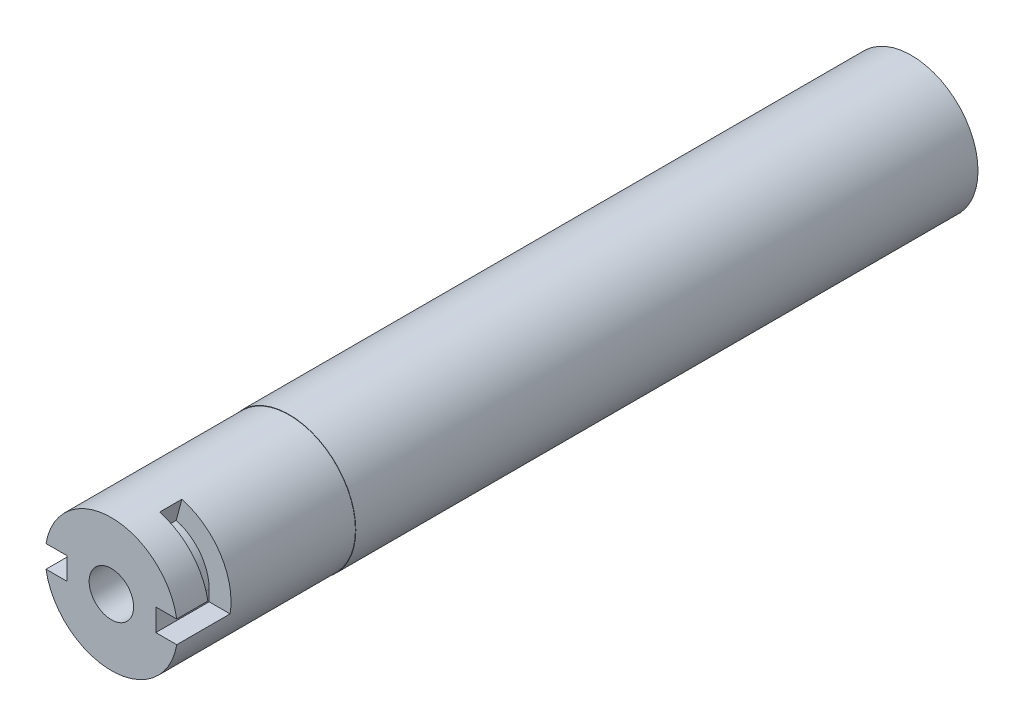
ISO-10303-21;
HEADER;
FILE_DESCRIPTION(('STEP AP214'),'2;1');
FILE_NAME('part.step','',(''),(''),'','','');
FILE_SCHEMA(('AUTOMOTIVE_DESIGN { 1 0 10303 214 1 1 1 1 }'));
ENDSEC;
DATA;
#1=APPLICATION_CONTEXT('core data for automotive mechanical design processes');
#2=APPLICATION_PROTOCOL_DEFINITION('international standard','automotive_design',2000,#1);
#3=PRODUCT_CONTEXT('',#1,'mechanical');
#4=PRODUCT('Part','Part','',(#3));
#5=PRODUCT_RELATED_PRODUCT_CATEGORY('part','',(#4));
#6=PRODUCT_DEFINITION_FORMATION('','',#4);
#7=PRODUCT_DEFINITION_CONTEXT('part definition',#1,'design');
#8=PRODUCT_DEFINITION('design','',#6,#7);
#9=PRODUCT_DEFINITION_SHAPE('','',#8);
#10=(LENGTH_UNIT() NAMED_UNIT(*) SI_UNIT(.MILLI.,.METRE.));
#11=(NAMED_UNIT(*) PLANE_ANGLE_UNIT() SI_UNIT($,.RADIAN.));
#12=(NAMED_UNIT(*) SI_UNIT($,.STERADIAN.) SOLID_ANGLE_UNIT());
#13=UNCERTAINTY_MEASURE_WITH_UNIT(LENGTH_MEASURE(1.E-05),#10,'distance_accuracy_value','');
#14=(GEOMETRIC_REPRESENTATION_CONTEXT(3) GLOBAL_UNCERTAINTY_ASSIGNED_CONTEXT((#13)) GLOBAL_UNIT_ASSIGNED_CONTEXT((#10,
#11,#12)) REPRESENTATION_CONTEXT('',''));
#15=CARTESIAN_POINT('',(0.,0.,0.));
#16=DIRECTION('',(0.,0.,1.));
#17=DIRECTION('',(1.,0.,0.));
#18=AXIS2_PLACEMENT_3D('',#15,#16,#17);
#19=CARTESIAN_POINT('',(0.,0.,114.3));
#20=DIRECTION('',(0.,0.,-1.));
#21=DIRECTION('',(-1.,0.,0.));
#22=AXIS2_PLACEMENT_3D('',#19,#20,#21);
#23=CYLINDRICAL_SURFACE('',#22,9.525);
#24=CARTESIAN_POINT('',(0.,0.,0.));
#25=DIRECTION('',(0.,0.,1.));
#26=DIRECTION('',(1.,0.,0.));
#27=AXIS2_PLACEMENT_3D('',#24,#25,#26);
#28=CIRCLE('',#27,9.525);
#29=CARTESIAN_POINT('',(9.525,0.,0.));
#30=VERTEX_POINT('',#29);
#31=EDGE_CURVE('E240',#30,#30,#28,.T.);
#32=ORIENTED_EDGE('',*,*,#31,.T.);
#33=EDGE_LOOP('',(#32));
#34=FACE_BOUND('',#33,.T.);
#35=CARTESIAN_POINT('',(0.,0.,88.9));
#36=DIRECTION('',(0.,0.,1.));
#37=DIRECTION('',(1.,0.,0.));
#38=AXIS2_PLACEMENT_3D('',#35,#36,#37);
#39=CIRCLE('',#38,9.525);
#40=CARTESIAN_POINT('',(9.525,0.,88.9));
#41=VERTEX_POINT('',#40);
#42=EDGE_CURVE('E362',#41,#41,#39,.T.);
#43=ORIENTED_EDGE('',*,*,#42,.F.);
#44=EDGE_LOOP('',(#43));
#45=FACE_BOUND('',#44,.T.);
#46=ADVANCED_FACE('F41',(#34,#45),#23,.T.);
#47=CARTESIAN_POINT('',(0.,1.5875,106.68));
#48=DIRECTION('',(0.,1.,0.));
#49=DIRECTION('',(0.,0.,1.));
#50=AXIS2_PLACEMENT_3D('',#47,#48,#49);
#51=PLANE('',#50);
#52=DIRECTION('',(0.,0.,1.));
#53=VECTOR('',#52,1.);
#54=CARTESIAN_POINT('',(9.34025210526996,1.5875,88.9));
#55=LINE('',#54,#53);
#56=CARTESIAN_POINT('',(9.34025210526996,1.5875,114.3));
#57=VERTEX_POINT('',#56);
#58=CARTESIAN_POINT('',(9.34025210526996,1.5875,109.855));
#59=VERTEX_POINT('',#58);
#60=EDGE_CURVE('E163',#57,#59,#55,.F.);
#61=ORIENTED_EDGE('',*,*,#60,.F.);
#62=DIRECTION('',(-1.,0.,0.));
#63=VECTOR('',#62,1.);
#64=CARTESIAN_POINT('',(0.,1.5875,114.3));
#65=LINE('',#64,#63);
#66=CARTESIAN_POINT('',(6.35,1.5875,114.3));
#67=VERTEX_POINT('',#66);
#68=EDGE_CURVE('E178',#57,#67,#65,.T.);
#69=ORIENTED_EDGE('',*,*,#68,.T.);
#70=DIRECTION('',(0.,0.,1.));
#71=VECTOR('',#70,1.);
#72=CARTESIAN_POINT('',(6.35,1.5875,106.68));
#73=LINE('',#72,#71);
#74=CARTESIAN_POINT('',(6.35,1.5875,109.855));
#75=VERTEX_POINT('',#74);
#76=EDGE_CURVE('E196',#75,#67,#73,.T.);
#77=ORIENTED_EDGE('',*,*,#76,.F.);
#78=DIRECTION('',(-1.,0.,0.));
#79=VECTOR('',#78,1.);
#80=CARTESIAN_POINT('',(0.,1.5875,109.855));
#81=LINE('',#80,#79);
#82=EDGE_CURVE('E179',#59,#75,#81,.T.);
#83=ORIENTED_EDGE('',*,*,#82,.F.);
#84=EDGE_LOOP('',(#61,#69,#77,#83));
#85=FACE_BOUND('',#84,.T.);
#86=ADVANCED_FACE('F176',(#85),#51,.F.);
#87=CARTESIAN_POINT('',(0.,0.,114.3));
#88=DIRECTION('',(0.,0.,1.));
#89=DIRECTION('',(1.,0.,0.));
#90=AXIS2_PLACEMENT_3D('',#87,#88,#89);
#91=PLANE('',#90);
#92=CARTESIAN_POINT('',(0.,0.,114.3));
#93=DIRECTION('',(0.,0.,1.));
#94=DIRECTION('',(1.,0.,0.));
#95=AXIS2_PLACEMENT_3D('',#92,#93,#94);
#96=CIRCLE('',#95,3.175);
#97=CARTESIAN_POINT('',(3.175,0.,114.3));
#98=VERTEX_POINT('',#97);
#99=EDGE_CURVE('E198',#98,#98,#96,.T.);
#100=ORIENTED_EDGE('',*,*,#99,.F.);
#101=EDGE_LOOP('',(#100));
#102=FACE_BOUND('',#101,.T.);
#103=ORIENTED_EDGE('',*,*,#68,.F.);
#104=CARTESIAN_POINT('',(0.,0.,114.3));
#105=DIRECTION('',(0.,0.,1.));
#106=DIRECTION('',(1.,0.,0.));
#107=AXIS2_PLACEMENT_3D('',#104,#105,#106);
#108=CIRCLE('',#107,9.4742);
#109=CARTESIAN_POINT('',(-9.34025210526996,1.5875,114.3));
#110=VERTEX_POINT('',#109);
#111=EDGE_CURVE('E160',#57,#110,#108,.T.);
#112=ORIENTED_EDGE('',*,*,#111,.T.);
#113=DIRECTION('',(1.,0.,0.));
#114=VECTOR('',#113,1.);
#115=CARTESIAN_POINT('',(0.,1.5875,114.3));
#116=LINE('',#115,#114);
#117=CARTESIAN_POINT('',(-6.35,1.5875,114.3));
#118=VERTEX_POINT('',#117);
#119=EDGE_CURVE('E215',#110,#118,#116,.T.);
#120=ORIENTED_EDGE('',*,*,#119,.T.);
#121=DIRECTION('',(0.,-1.,0.));
#122=VECTOR('',#121,1.);
#123=CARTESIAN_POINT('',(-6.35,0.,114.3));
#124=LINE('',#123,#122);
#125=CARTESIAN_POINT('',(-6.35,-1.5875,114.3));
#126=VERTEX_POINT('',#125);
#127=EDGE_CURVE('E211',#118,#126,#124,.T.);
#128=ORIENTED_EDGE('',*,*,#127,.T.);
#129=DIRECTION('',(-1.,0.,0.));
#130=VECTOR('',#129,1.);
#131=CARTESIAN_POINT('',(0.,-1.5875,114.3));
#132=LINE('',#131,#130);
#133=CARTESIAN_POINT('',(-9.34025210526996,-1.5875,114.3));
#134=VERTEX_POINT('',#133);
#135=EDGE_CURVE('E207',#126,#134,#132,.T.);
#136=ORIENTED_EDGE('',*,*,#135,.T.);
#137=CARTESIAN_POINT('',(9.34025210526996,-1.5875,114.3));
#138=VERTEX_POINT('',#137);
#139=EDGE_CURVE('E172',#134,#138,#108,.T.);
#140=ORIENTED_EDGE('',*,*,#139,.T.);
#141=DIRECTION('',(1.,0.,0.));
#142=VECTOR('',#141,1.);
#143=CARTESIAN_POINT('',(0.,-1.5875,114.3));
#144=LINE('',#143,#142);
#145=CARTESIAN_POINT('',(6.35,-1.5875,114.3));
#146=VERTEX_POINT('',#145);
#147=EDGE_CURVE('E186',#146,#138,#144,.T.);
#148=ORIENTED_EDGE('',*,*,#147,.F.);
#149=DIRECTION('',(0.,-1.,0.));
#150=VECTOR('',#149,1.);
#151=CARTESIAN_POINT('',(6.35,0.,114.3));
#152=LINE('',#151,#150);
#153=EDGE_CURVE('E68',#67,#146,#152,.T.);
#154=ORIENTED_EDGE('',*,*,#153,.F.);
#155=EDGE_LOOP('',(#103,#112,#120,#128,#136,#140,#148,#154));
#156=FACE_BOUND('',#155,.T.);
#157=ADVANCED_FACE('F183',(#102,#156),#91,.T.);
#158=CARTESIAN_POINT('',(0.,-1.5875,106.68));
#159=DIRECTION('',(0.,1.,0.));
#160=DIRECTION('',(0.,0.,1.));
#161=AXIS2_PLACEMENT_3D('',#158,#159,#160);
#162=PLANE('',#161);
#163=DIRECTION('',(1.,0.,0.));
#164=VECTOR('',#163,1.);
#165=CARTESIAN_POINT('',(0.,-1.5875,109.855));
#166=LINE('',#165,#164);
#167=CARTESIAN_POINT('',(-9.34025210526996,-1.5875,109.855));
#168=VERTEX_POINT('',#167);
#169=CARTESIAN_POINT('',(-6.35,-1.5875,109.855));
#170=VERTEX_POINT('',#169);
#171=EDGE_CURVE('E49',#168,#170,#166,.T.);
#172=ORIENTED_EDGE('',*,*,#171,.F.);
#173=DIRECTION('',(0.,0.,1.));
#174=VECTOR('',#173,1.);
#175=CARTESIAN_POINT('',(-9.34025210526996,-1.5875,88.9));
#176=LINE('',#175,#174);
#177=EDGE_CURVE('E269',#168,#134,#176,.T.);
#178=ORIENTED_EDGE('',*,*,#177,.T.);
#179=ORIENTED_EDGE('',*,*,#135,.F.);
#180=DIRECTION('',(0.,0.,1.));
#181=VECTOR('',#180,1.);
#182=CARTESIAN_POINT('',(-6.35,-1.5875,106.68));
#183=LINE('',#182,#181);
#184=EDGE_CURVE('E222',#170,#126,#183,.T.);
#185=ORIENTED_EDGE('',*,*,#184,.F.);
#186=EDGE_LOOP('',(#172,#178,#179,#185));
#187=FACE_BOUND('',#186,.T.);
#188=ADVANCED_FACE('F268',(#187),#162,.T.);
#189=CARTESIAN_POINT('',(0.,1.5875,106.68));
#190=DIRECTION('',(0.,-1.,0.));
#191=DIRECTION('',(0.,0.,-1.));
#192=AXIS2_PLACEMENT_3D('',#189,#190,#191);
#193=PLANE('',#192);
#194=ORIENTED_EDGE('',*,*,#119,.F.);
#195=DIRECTION('',(0.,0.,1.));
#196=VECTOR('',#195,1.);
#197=CARTESIAN_POINT('',(-9.34025210526996,1.5875,88.9));
#198=LINE('',#197,#196);
#199=CARTESIAN_POINT('',(-9.34025210526996,1.5875,106.68));
#200=VERTEX_POINT('',#199);
#201=EDGE_CURVE('E166',#110,#200,#198,.F.);
#202=ORIENTED_EDGE('',*,*,#201,.T.);
#203=DIRECTION('',(1.,0.,0.));
#204=VECTOR('',#203,1.);
#205=CARTESIAN_POINT('',(0.,1.5875,106.68));
#206=LINE('',#205,#204);
#207=CARTESIAN_POINT('',(-6.35,1.5875,106.68));
#208=VERTEX_POINT('',#207);
#209=EDGE_CURVE('E206',#200,#208,#206,.T.);
#210=ORIENTED_EDGE('',*,*,#209,.T.);
#211=DIRECTION('',(0.,0.,1.));
#212=VECTOR('',#211,1.);
#213=CARTESIAN_POINT('',(-6.35,1.5875,106.68));
#214=LINE('',#213,#212);
#215=EDGE_CURVE('E210',#208,#118,#214,.T.);
#216=ORIENTED_EDGE('',*,*,#215,.T.);
#217=EDGE_LOOP('',(#194,#202,#210,#216));
#218=FACE_BOUND('',#217,.T.);
#219=ADVANCED_FACE('F274',(#218),#193,.T.);
#220=CARTESIAN_POINT('',(0.,0.,106.68));
#221=DIRECTION('',(0.,0.,1.));
#222=DIRECTION('',(1.,0.,0.));
#223=AXIS2_PLACEMENT_3D('',#220,#221,#222);
#224=PLANE('',#223);
#225=ORIENTED_EDGE('',*,*,#209,.F.);
#226=CARTESIAN_POINT('',(0.,0.,106.68));
#227=DIRECTION('',(0.,0.,1.));
#228=DIRECTION('',(1.,0.,0.));
#229=AXIS2_PLACEMENT_3D('',#226,#227,#228);
#230=CIRCLE('',#229,9.4742);
#231=CARTESIAN_POINT('',(-2.45210339711027,-9.1513744634279,106.68));
#232=VERTEX_POINT('',#231);
#233=EDGE_CURVE('E280',#200,#232,#230,.T.);
#234=ORIENTED_EDGE('',*,*,#233,.T.);
#235=DIRECTION('',(-0.258819045102518,-0.965925826289069,0.));
#236=VECTOR('',#235,1.);
#237=CARTESIAN_POINT('',(-2.43077066583678,-9.07175962645105,106.68));
#238=LINE('',#237,#236);
#239=CARTESIAN_POINT('',(-1.64350093640097,-6.13362899693558,106.68));
#240=VERTEX_POINT('',#239);
#241=EDGE_CURVE('E283',#240,#232,#238,.T.);
#242=ORIENTED_EDGE('',*,*,#241,.F.);
#243=CARTESIAN_POINT('',(0.,0.,106.68));
#244=DIRECTION('',(0.,0.,-1.));
#245=DIRECTION('',(-1.,0.,0.));
#246=AXIS2_PLACEMENT_3D('',#243,#244,#245);
#247=CIRCLE('',#246,6.34999999999999);
#248=CARTESIAN_POINT('',(-6.34999999999998,0.,106.68));
#249=VERTEX_POINT('',#248);
#250=EDGE_CURVE('E282',#240,#249,#247,.T.);
#251=ORIENTED_EDGE('',*,*,#250,.T.);
#252=DIRECTION('',(0.,-1.,0.));
#253=VECTOR('',#252,1.);
#254=CARTESIAN_POINT('',(-6.35,0.,106.68));
#255=LINE('',#254,#253);
#256=EDGE_CURVE('E202',#208,#249,#255,.T.);
#257=ORIENTED_EDGE('',*,*,#256,.F.);
#258=EDGE_LOOP('',(#225,#234,#242,#251,#257));
#259=FACE_BOUND('',#258,.T.);
#260=ADVANCED_FACE('F278',(#259),#224,.T.);
#261=CARTESIAN_POINT('',(0.,-1.5875,106.68));
#262=DIRECTION('',(0.,-1.,0.));
#263=DIRECTION('',(0.,0.,-1.));
#264=AXIS2_PLACEMENT_3D('',#261,#262,#263);
#265=PLANE('',#264);
#266=DIRECTION('',(0.,0.,1.));
#267=VECTOR('',#266,1.);
#268=CARTESIAN_POINT('',(9.34025210526996,-1.5875,88.9));
#269=LINE('',#268,#267);
#270=CARTESIAN_POINT('',(9.34025210526996,-1.5875,106.68));
#271=VERTEX_POINT('',#270);
#272=EDGE_CURVE('E181',#271,#138,#269,.T.);
#273=ORIENTED_EDGE('',*,*,#272,.F.);
#274=DIRECTION('',(1.,0.,0.));
#275=VECTOR('',#274,1.);
#276=CARTESIAN_POINT('',(0.,-1.5875,106.68));
#277=LINE('',#276,#275);
#278=CARTESIAN_POINT('',(6.35,-1.5875,106.68));
#279=VERTEX_POINT('',#278);
#280=EDGE_CURVE('E189',#279,#271,#277,.T.);
#281=ORIENTED_EDGE('',*,*,#280,.F.);
#282=DIRECTION('',(0.,0.,1.));
#283=VECTOR('',#282,1.);
#284=CARTESIAN_POINT('',(6.35,-1.5875,106.68));
#285=LINE('',#284,#283);
#286=EDGE_CURVE('E199',#279,#146,#285,.T.);
#287=ORIENTED_EDGE('',*,*,#286,.T.);
#288=ORIENTED_EDGE('',*,*,#147,.T.);
#289=EDGE_LOOP('',(#273,#281,#287,#288));
#290=FACE_BOUND('',#289,.T.);
#291=ADVANCED_FACE('F389',(#290),#265,.F.);
#292=CARTESIAN_POINT('',(0.,0.,106.68));
#293=DIRECTION('',(0.,0.,1.));
#294=DIRECTION('',(1.,0.,0.));
#295=AXIS2_PLACEMENT_3D('',#292,#293,#294);
#296=PLANE('',#295);
#297=ORIENTED_EDGE('',*,*,#280,.T.);
#298=CARTESIAN_POINT('',(0.,0.,106.68));
#299=DIRECTION('',(0.,0.,1.));
#300=DIRECTION('',(1.,0.,0.));
#301=AXIS2_PLACEMENT_3D('',#298,#299,#300);
#302=CIRCLE('',#301,9.4742);
#303=CARTESIAN_POINT('',(2.45210339711029,9.1513744634279,106.68));
#304=VERTEX_POINT('',#303);
#305=EDGE_CURVE('E382',#271,#304,#302,.T.);
#306=ORIENTED_EDGE('',*,*,#305,.T.);
#307=DIRECTION('',(-0.258819045102518,-0.965925826289069,0.));
#308=VECTOR('',#307,1.);
#309=CARTESIAN_POINT('',(2.46525140460149,9.20044349540337,106.68));
#310=LINE('',#309,#308);
#311=CARTESIAN_POINT('',(1.643500936401,6.13362899693558,106.68));
#312=VERTEX_POINT('',#311);
#313=EDGE_CURVE('E316',#304,#312,#310,.T.);
#314=ORIENTED_EDGE('',*,*,#313,.T.);
#315=CARTESIAN_POINT('',(0.,0.,106.68));
#316=DIRECTION('',(0.,0.,-1.));
#317=DIRECTION('',(-1.,0.,0.));
#318=AXIS2_PLACEMENT_3D('',#315,#316,#317);
#319=CIRCLE('',#318,6.34999999999999);
#320=CARTESIAN_POINT('',(6.35,0.,106.68));
#321=VERTEX_POINT('',#320);
#322=EDGE_CURVE('E298',#312,#321,#319,.T.);
#323=ORIENTED_EDGE('',*,*,#322,.T.);
#324=DIRECTION('',(0.,-1.,0.));
#325=VECTOR('',#324,1.);
#326=CARTESIAN_POINT('',(6.35,0.,106.68));
#327=LINE('',#326,#325);
#328=EDGE_CURVE('E185',#321,#279,#327,.T.);
#329=ORIENTED_EDGE('',*,*,#328,.T.);
#330=EDGE_LOOP('',(#297,#306,#314,#323,#329));
#331=FACE_BOUND('',#330,.T.);
#332=ADVANCED_FACE('F391',(#331),#296,.T.);
#333=CARTESIAN_POINT('',(1.643500936401,6.13362899693558,109.855));
#334=DIRECTION('',(0.,0.,-1.));
#335=DIRECTION('',(-1.,0.,0.));
#336=AXIS2_PLACEMENT_3D('',#333,#334,#335);
#337=PLANE('',#336);
#338=DIRECTION('',(0.258819045102518,0.965925826289069,0.));
#339=VECTOR('',#338,1.);
#340=CARTESIAN_POINT('',(1.643500936401,6.13362899693558,109.855));
#341=LINE('',#340,#339);
#342=CARTESIAN_POINT('',(1.643500936401,6.13362899693558,109.855));
#343=VERTEX_POINT('',#342);
#344=CARTESIAN_POINT('',(2.45210339711029,9.1513744634279,109.855));
#345=VERTEX_POINT('',#344);
#346=EDGE_CURVE('E327',#343,#345,#341,.T.);
#347=ORIENTED_EDGE('',*,*,#346,.T.);
#348=CARTESIAN_POINT('',(0.,0.,109.855));
#349=DIRECTION('',(0.,0.,-1.));
#350=DIRECTION('',(-1.,0.,0.));
#351=AXIS2_PLACEMENT_3D('',#348,#349,#350);
#352=CIRCLE('',#351,9.4742);
#353=EDGE_CURVE('E380',#345,#59,#352,.T.);
#354=ORIENTED_EDGE('',*,*,#353,.T.);
#355=ORIENTED_EDGE('',*,*,#82,.T.);
#356=DIRECTION('',(0.,-1.,0.));
#357=VECTOR('',#356,1.);
#358=CARTESIAN_POINT('',(6.35,0.,109.855));
#359=LINE('',#358,#357);
#360=CARTESIAN_POINT('',(6.35,0.,109.855));
#361=VERTEX_POINT('',#360);
#362=EDGE_CURVE('E266',#75,#361,#359,.T.);
#363=ORIENTED_EDGE('',*,*,#362,.T.);
#364=CARTESIAN_POINT('',(0.,0.,109.855));
#365=DIRECTION('',(0.,0.,-1.));
#366=DIRECTION('',(-1.,0.,0.));
#367=AXIS2_PLACEMENT_3D('',#364,#365,#366);
#368=CIRCLE('',#367,6.34999999999999);
#369=EDGE_CURVE('E314',#343,#361,#368,.T.);
#370=ORIENTED_EDGE('',*,*,#369,.F.);
#371=EDGE_LOOP('',(#347,#354,#355,#363,#370));
#372=FACE_BOUND('',#371,.T.);
#373=ADVANCED_FACE('F336',(#372),#337,.T.);
#374=CARTESIAN_POINT('',(0.,0.,0.));
#375=DIRECTION('',(-0.965925826289069,0.258819045102518,0.));
#376=DIRECTION('',(0.,0.,1.));
#377=AXIS2_PLACEMENT_3D('',#374,#375,#376);
#378=PLANE('',#377);
#379=DIRECTION('',(0.,0.,1.));
#380=VECTOR('',#379,1.);
#381=CARTESIAN_POINT('',(2.45210339711029,9.1513744634279,88.9));
#382=LINE('',#381,#380);
#383=EDGE_CURVE('E378',#345,#304,#382,.F.);
#384=ORIENTED_EDGE('',*,*,#383,.F.);
#385=ORIENTED_EDGE('',*,*,#346,.F.);
#386=DIRECTION('',(0.,0.,1.));
#387=VECTOR('',#386,1.);
#388=CARTESIAN_POINT('',(1.643500936401,6.13362899693558,106.68));
#389=LINE('',#388,#387);
#390=EDGE_CURVE('E321',#312,#343,#389,.T.);
#391=ORIENTED_EDGE('',*,*,#390,.F.);
#392=ORIENTED_EDGE('',*,*,#313,.F.);
#393=EDGE_LOOP('',(#384,#385,#391,#392));
#394=FACE_BOUND('',#393,.T.);
#395=ADVANCED_FACE('F395',(#394),#378,.F.);
#396=CARTESIAN_POINT('',(-1.64350093640097,-6.13362899693558,109.855));
#397=DIRECTION('',(0.,0.,1.));
#398=DIRECTION('',(1.,0.,0.));
#399=AXIS2_PLACEMENT_3D('',#396,#397,#398);
#400=PLANE('',#399);
#401=CARTESIAN_POINT('',(0.,0.,109.855));
#402=DIRECTION('',(0.,0.,1.));
#403=DIRECTION('',(1.,0.,0.));
#404=AXIS2_PLACEMENT_3D('',#401,#402,#403);
#405=CIRCLE('',#404,9.4742);
#406=CARTESIAN_POINT('',(-2.45210339711026,-9.1513744634279,109.855));
#407=VERTEX_POINT('',#406);
#408=EDGE_CURVE('E58',#168,#407,#405,.T.);
#409=ORIENTED_EDGE('',*,*,#408,.F.);
#410=ORIENTED_EDGE('',*,*,#171,.T.);
#411=DIRECTION('',(0.,1.,0.));
#412=VECTOR('',#411,1.);
#413=CARTESIAN_POINT('',(-6.35,0.,109.855));
#414=LINE('',#413,#412);
#415=CARTESIAN_POINT('',(-6.34999999999998,0.,109.855));
#416=VERTEX_POINT('',#415);
#417=EDGE_CURVE('E216',#170,#416,#414,.T.);
#418=ORIENTED_EDGE('',*,*,#417,.T.);
#419=CARTESIAN_POINT('',(0.,0.,109.855));
#420=DIRECTION('',(0.,0.,-1.));
#421=DIRECTION('',(-1.,0.,0.));
#422=AXIS2_PLACEMENT_3D('',#419,#420,#421);
#423=CIRCLE('',#422,6.34999999999999);
#424=CARTESIAN_POINT('',(-1.64350093640097,-6.13362899693558,109.855));
#425=VERTEX_POINT('',#424);
#426=EDGE_CURVE('E288',#425,#416,#423,.T.);
#427=ORIENTED_EDGE('',*,*,#426,.F.);
#428=DIRECTION('',(0.258819045102518,0.965925826289069,0.));
#429=VECTOR('',#428,1.);
#430=CARTESIAN_POINT('',(-1.64350093640097,-6.13362899693558,109.855));
#431=LINE('',#430,#429);
#432=EDGE_CURVE('E289',#407,#425,#431,.T.);
#433=ORIENTED_EDGE('',*,*,#432,.F.);
#434=EDGE_LOOP('',(#409,#410,#418,#427,#433));
#435=FACE_BOUND('',#434,.T.);
#436=ADVANCED_FACE('F252',(#435),#400,.F.);
#437=CARTESIAN_POINT('',(0.,0.,0.));
#438=DIRECTION('',(0.965925826289069,-0.258819045102518,0.));
#439=DIRECTION('',(0.,0.,-1.));
#440=AXIS2_PLACEMENT_3D('',#437,#438,#439);
#441=PLANE('',#440);
#442=DIRECTION('',(0.,0.,1.));
#443=VECTOR('',#442,1.);
#444=CARTESIAN_POINT('',(-2.45210339711027,-9.1513744634279,88.9));
#445=LINE('',#444,#443);
#446=EDGE_CURVE('E12',#407,#232,#445,.F.);
#447=ORIENTED_EDGE('',*,*,#446,.F.);
#448=ORIENTED_EDGE('',*,*,#432,.T.);
#449=DIRECTION('',(0.,0.,-1.));
#450=VECTOR('',#449,1.);
#451=CARTESIAN_POINT('',(-1.64350093640097,-6.13362899693558,106.68));
#452=LINE('',#451,#450);
#453=EDGE_CURVE('E293',#425,#240,#452,.T.);
#454=ORIENTED_EDGE('',*,*,#453,.T.);
#455=ORIENTED_EDGE('',*,*,#241,.T.);
#456=EDGE_LOOP('',(#447,#448,#454,#455));
#457=FACE_BOUND('',#456,.T.);
#458=ADVANCED_FACE('F340',(#457),#441,.F.);
#459=CARTESIAN_POINT('',(6.35,0.,106.68));
#460=DIRECTION('',(-1.,0.,0.));
#461=DIRECTION('',(0.,0.,1.));
#462=AXIS2_PLACEMENT_3D('',#459,#460,#461);
#463=PLANE('',#462);
#464=ORIENTED_EDGE('',*,*,#362,.F.);
#465=ORIENTED_EDGE('',*,*,#76,.T.);
#466=ORIENTED_EDGE('',*,*,#153,.T.);
#467=ORIENTED_EDGE('',*,*,#286,.F.);
#468=ORIENTED_EDGE('',*,*,#328,.F.);
#469=DIRECTION('',(0.,0.,1.));
#470=VECTOR('',#469,1.);
#471=CARTESIAN_POINT('',(6.35,0.,106.68));
#472=LINE('',#471,#470);
#473=EDGE_CURVE('E306',#321,#361,#472,.T.);
#474=ORIENTED_EDGE('',*,*,#473,.T.);
#475=EDGE_LOOP('',(#464,#465,#466,#467,#468,#474));
#476=FACE_BOUND('',#475,.T.);
#477=ADVANCED_FACE('F337',(#476),#463,.F.);
#478=CARTESIAN_POINT('',(0.,0.,0.));
#479=DIRECTION('',(0.,0.,1.));
#480=DIRECTION('',(1.,0.,0.));
#481=AXIS2_PLACEMENT_3D('',#478,#479,#480);
#482=PLANE('',#481);
#483=CARTESIAN_POINT('',(0.,0.,0.));
#484=DIRECTION('',(0.,0.,-1.));
#485=DIRECTION('',(-1.,0.,0.));
#486=AXIS2_PLACEMENT_3D('',#483,#484,#485);
#487=CIRCLE('',#486,5.55625);
#488=CARTESIAN_POINT('',(-5.55625,0.,0.));
#489=VERTEX_POINT('',#488);
#490=EDGE_CURVE('E232',#489,#489,#487,.T.);
#491=ORIENTED_EDGE('',*,*,#490,.F.);
#492=EDGE_LOOP('',(#491));
#493=FACE_BOUND('',#492,.T.);
#494=ORIENTED_EDGE('',*,*,#31,.F.);
#495=EDGE_LOOP('',(#494));
#496=FACE_BOUND('',#495,.T.);
#497=ADVANCED_FACE('F339',(#493,#496),#482,.F.);
#498=CARTESIAN_POINT('',(0.,0.,101.6));
#499=DIRECTION('',(0.,0.,1.));
#500=DIRECTION('',(1.,0.,0.));
#501=AXIS2_PLACEMENT_3D('',#498,#499,#500);
#502=PLANE('',#501);
#503=CARTESIAN_POINT('',(0.,0.,101.6));
#504=DIRECTION('',(0.,0.,1.));
#505=DIRECTION('',(1.,0.,0.));
#506=AXIS2_PLACEMENT_3D('',#503,#504,#505);
#507=CIRCLE('',#506,3.175);
#508=CARTESIAN_POINT('',(3.175,0.,101.6));
#509=VERTEX_POINT('',#508);
#510=EDGE_CURVE('E231',#509,#509,#507,.T.);
#511=ORIENTED_EDGE('',*,*,#510,.T.);
#512=EDGE_LOOP('',(#511));
#513=FACE_BOUND('',#512,.T.);
#514=CARTESIAN_POINT('',(0.,0.,101.6));
#515=DIRECTION('',(0.,0.,1.));
#516=DIRECTION('',(1.,0.,0.));
#517=AXIS2_PLACEMENT_3D('',#514,#515,#516);
#518=CIRCLE('',#517,5.55625);
#519=CARTESIAN_POINT('',(5.55625,0.,101.6));
#520=VERTEX_POINT('',#519);
#521=EDGE_CURVE('E236',#520,#520,#518,.F.);
#522=ORIENTED_EDGE('',*,*,#521,.T.);
#523=EDGE_LOOP('',(#522));
#524=FACE_BOUND('',#523,.T.);
#525=ADVANCED_FACE('F346',(#513,#524),#502,.F.);
#526=CARTESIAN_POINT('',(0.,0.,130.015448211871));
#527=DIRECTION('',(0.,0.,-1.));
#528=DIRECTION('',(-1.,0.,0.));
#529=AXIS2_PLACEMENT_3D('',#526,#527,#528);
#530=CYLINDRICAL_SURFACE('',#529,5.55625);
#531=ORIENTED_EDGE('',*,*,#490,.T.);
#532=EDGE_LOOP('',(#531));
#533=FACE_BOUND('',#532,.T.);
#534=ORIENTED_EDGE('',*,*,#521,.F.);
#535=EDGE_LOOP('',(#534));
#536=FACE_BOUND('',#535,.T.);
#537=ADVANCED_FACE('F429',(#533,#536),#530,.F.);
#538=CARTESIAN_POINT('',(0.,0.,0.));
#539=DIRECTION('',(0.,0.,1.));
#540=DIRECTION('',(1.,0.,0.));
#541=AXIS2_PLACEMENT_3D('',#538,#539,#540);
#542=CYLINDRICAL_SURFACE('',#541,3.175);
#543=ORIENTED_EDGE('',*,*,#99,.T.);
#544=EDGE_LOOP('',(#543));
#545=FACE_BOUND('',#544,.T.);
#546=ORIENTED_EDGE('',*,*,#510,.F.);
#547=EDGE_LOOP('',(#546));
#548=FACE_BOUND('',#547,.T.);
#549=ADVANCED_FACE('F426',(#545,#548),#542,.F.);
#550=CARTESIAN_POINT('',(-6.35,0.,106.68));
#551=DIRECTION('',(-1.,0.,0.));
#552=DIRECTION('',(0.,0.,1.));
#553=AXIS2_PLACEMENT_3D('',#550,#551,#552);
#554=PLANE('',#553);
#555=ORIENTED_EDGE('',*,*,#417,.F.);
#556=ORIENTED_EDGE('',*,*,#184,.T.);
#557=ORIENTED_EDGE('',*,*,#127,.F.);
#558=ORIENTED_EDGE('',*,*,#215,.F.);
#559=ORIENTED_EDGE('',*,*,#256,.T.);
#560=DIRECTION('',(0.,0.,-1.));
#561=VECTOR('',#560,1.);
#562=CARTESIAN_POINT('',(-6.34999999999998,0.,106.68));
#563=LINE('',#562,#561);
#564=EDGE_CURVE('E180',#416,#249,#563,.T.);
#565=ORIENTED_EDGE('',*,*,#564,.F.);
#566=EDGE_LOOP('',(#555,#556,#557,#558,#559,#565));
#567=FACE_BOUND('',#566,.T.);
#568=ADVANCED_FACE('F261',(#567),#554,.T.);
#569=CARTESIAN_POINT('',(0.,0.,0.));
#570=DIRECTION('',(0.,0.,-1.));
#571=DIRECTION('',(-1.,0.,0.));
#572=AXIS2_PLACEMENT_3D('',#569,#570,#571);
#573=CYLINDRICAL_SURFACE('',#572,6.34999999999999);
#574=ORIENTED_EDGE('',*,*,#369,.T.);
#575=ORIENTED_EDGE('',*,*,#473,.F.);
#576=ORIENTED_EDGE('',*,*,#322,.F.);
#577=ORIENTED_EDGE('',*,*,#390,.T.);
#578=EDGE_LOOP('',(#574,#575,#576,#577));
#579=FACE_BOUND('',#578,.T.);
#580=ADVANCED_FACE('F331',(#579),#573,.T.);
#581=CARTESIAN_POINT('',(0.,0.,0.));
#582=DIRECTION('',(0.,0.,-1.));
#583=DIRECTION('',(-1.,0.,0.));
#584=AXIS2_PLACEMENT_3D('',#581,#582,#583);
#585=CYLINDRICAL_SURFACE('',#584,6.34999999999999);
#586=ORIENTED_EDGE('',*,*,#426,.T.);
#587=ORIENTED_EDGE('',*,*,#564,.T.);
#588=ORIENTED_EDGE('',*,*,#250,.F.);
#589=ORIENTED_EDGE('',*,*,#453,.F.);
#590=EDGE_LOOP('',(#586,#587,#588,#589));
#591=FACE_BOUND('',#590,.T.);
#592=ADVANCED_FACE('F291',(#591),#585,.T.);
#593=CARTESIAN_POINT('',(0.,0.,88.9));
#594=DIRECTION('',(0.,0.,1.));
#595=DIRECTION('',(1.,0.,0.));
#596=AXIS2_PLACEMENT_3D('',#593,#594,#595);
#597=CYLINDRICAL_SURFACE('',#596,9.4742);
#598=CARTESIAN_POINT('',(0.,0.,88.9));
#599=DIRECTION('',(0.,0.,1.));
#600=DIRECTION('',(1.,0.,0.));
#601=AXIS2_PLACEMENT_3D('',#598,#599,#600);
#602=CIRCLE('',#601,9.4742);
#603=CARTESIAN_POINT('',(9.4742,0.,88.9));
#604=VERTEX_POINT('',#603);
#605=EDGE_CURVE('E171',#604,#604,#602,.T.);
#606=ORIENTED_EDGE('',*,*,#605,.T.);
#607=EDGE_LOOP('',(#606));
#608=FACE_BOUND('',#607,.T.);
#609=ORIENTED_EDGE('',*,*,#60,.T.);
#610=ORIENTED_EDGE('',*,*,#353,.F.);
#611=ORIENTED_EDGE('',*,*,#383,.T.);
#612=ORIENTED_EDGE('',*,*,#305,.F.);
#613=ORIENTED_EDGE('',*,*,#272,.T.);
#614=ORIENTED_EDGE('',*,*,#139,.F.);
#615=ORIENTED_EDGE('',*,*,#177,.F.);
#616=ORIENTED_EDGE('',*,*,#408,.T.);
#617=ORIENTED_EDGE('',*,*,#446,.T.);
#618=ORIENTED_EDGE('',*,*,#233,.F.);
#619=ORIENTED_EDGE('',*,*,#201,.F.);
#620=ORIENTED_EDGE('',*,*,#111,.F.);
#621=EDGE_LOOP('',(#609,#610,#611,#612,#613,#614,#615,#616,#617,#618,#619,#620));
#622=FACE_BOUND('',#621,.T.);
#623=ADVANCED_FACE('F162',(#608,#622),#597,.T.);
#624=CARTESIAN_POINT('',(0.,0.,88.9));
#625=DIRECTION('',(0.,0.,1.));
#626=DIRECTION('',(1.,0.,0.));
#627=AXIS2_PLACEMENT_3D('',#624,#625,#626);
#628=PLANE('',#627);
#629=ORIENTED_EDGE('',*,*,#605,.F.);
#630=EDGE_LOOP('',(#629));
#631=FACE_BOUND('',#630,.T.);
#632=ORIENTED_EDGE('',*,*,#42,.T.);
#633=EDGE_LOOP('',(#632));
#634=FACE_BOUND('',#633,.T.);
#635=ADVANCED_FACE('F405',(#631,#634),#628,.T.);
#636=CLOSED_SHELL('',(#46,#86,#157,#188,#219,#260,#291,#332,#373,#395,#436,#458,#477,#497,#525,
#537,#549,#568,#580,#592,#623,#635));
#637=MANIFOLD_SOLID_BREP('B2',#636);
#638=ADVANCED_BREP_SHAPE_REPRESENTATION('',(#18,#637),#14);
#639=SHAPE_DEFINITION_REPRESENTATION(#9,#638);
ENDSEC;
END-ISO-10303-21;
